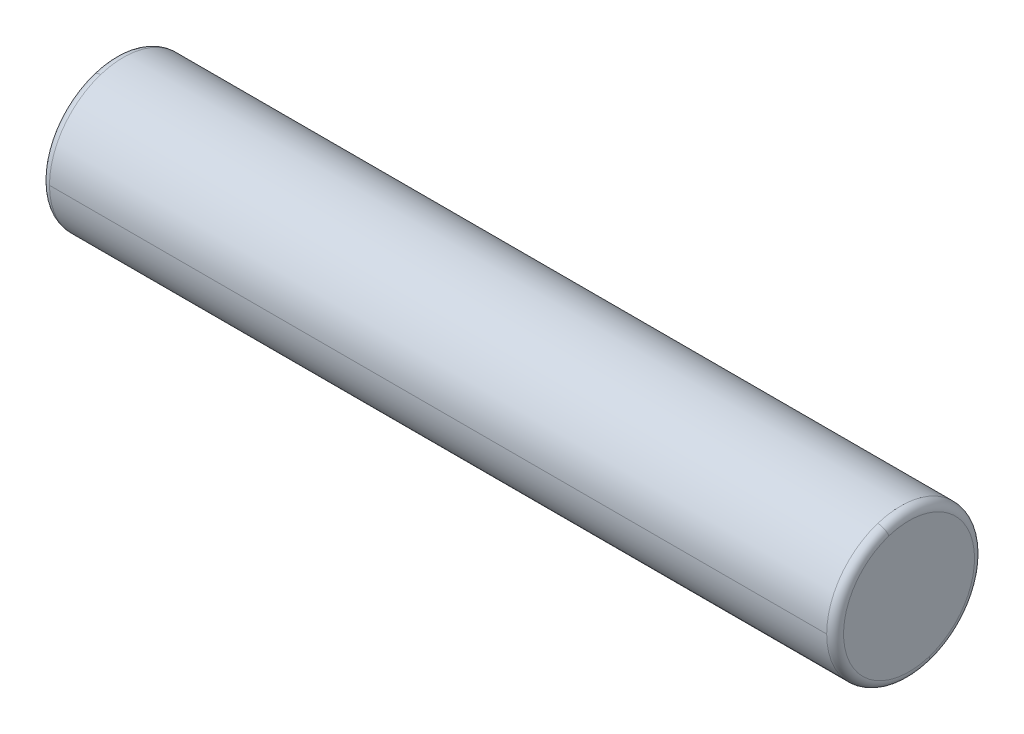
ISO-10303-21;
HEADER;
FILE_DESCRIPTION(('STEP AP214'),'2;1');
FILE_NAME('part.step','',(''),(''),'','','');
FILE_SCHEMA(('AUTOMOTIVE_DESIGN { 1 0 10303 214 1 1 1 1 }'));
ENDSEC;
DATA;
#1=APPLICATION_CONTEXT('core data for automotive mechanical design processes');
#2=APPLICATION_PROTOCOL_DEFINITION('international standard','automotive_design',2000,#1);
#3=PRODUCT_CONTEXT('',#1,'mechanical');
#4=PRODUCT('Part','Part','',(#3));
#5=PRODUCT_RELATED_PRODUCT_CATEGORY('part','',(#4));
#6=PRODUCT_DEFINITION_FORMATION('','',#4);
#7=PRODUCT_DEFINITION_CONTEXT('part definition',#1,'design');
#8=PRODUCT_DEFINITION('design','',#6,#7);
#9=PRODUCT_DEFINITION_SHAPE('','',#8);
#10=(LENGTH_UNIT() NAMED_UNIT(*) SI_UNIT(.MILLI.,.METRE.));
#11=(NAMED_UNIT(*) PLANE_ANGLE_UNIT() SI_UNIT($,.RADIAN.));
#12=(NAMED_UNIT(*) SI_UNIT($,.STERADIAN.) SOLID_ANGLE_UNIT());
#13=UNCERTAINTY_MEASURE_WITH_UNIT(LENGTH_MEASURE(1.E-05),#10,'distance_accuracy_value','');
#14=(GEOMETRIC_REPRESENTATION_CONTEXT(3) GLOBAL_UNCERTAINTY_ASSIGNED_CONTEXT((#13)) GLOBAL_UNIT_ASSIGNED_CONTEXT((#10,
#11,#12)) REPRESENTATION_CONTEXT('',''));
#15=CARTESIAN_POINT('',(0.,0.,0.));
#16=DIRECTION('',(0.,0.,1.));
#17=DIRECTION('',(1.,0.,0.));
#18=AXIS2_PLACEMENT_3D('',#15,#16,#17);
#19=CARTESIAN_POINT('',(3.1,29.25,0.));
#20=DIRECTION('',(1.,0.,0.));
#21=DIRECTION('',(0.,0.,-1.));
#22=AXIS2_PLACEMENT_3D('',#19,#20,#21);
#23=PLANE('',#22);
#24=CARTESIAN_POINT('',(3.1,30.724137600257,0.478976341281001));
#25=CARTESIAN_POINT('',(3.1,30.7163008719419,0.503097051966079));
#26=CARTESIAN_POINT('',(3.1,30.7078711460442,0.527025037923453));
#27=CARTESIAN_POINT('',(3.1,30.6898482176225,0.574438756045452));
#28=CARTESIAN_POINT('',(3.1,30.6802550150986,0.597924488210076));
#29=CARTESIAN_POINT('',(3.1,30.6599276519636,0.644396894409227));
#30=CARTESIAN_POINT('',(3.1,30.6491934913525,0.667383568443754));
#31=CARTESIAN_POINT('',(3.1,30.6266102302895,0.712802541800716));
#32=CARTESIAN_POINT('',(3.1,30.6147611298377,0.735234841123151));
#33=CARTESIAN_POINT('',(3.1,30.589976492087,0.779491007516879));
#34=CARTESIAN_POINT('',(3.1,30.5770409547882,0.801314874588172));
#35=CARTESIAN_POINT('',(3.1,30.550114617581,0.844301605203733));
#36=CARTESIAN_POINT('',(3.1,30.5361238176727,0.865464468748));
#37=CARTESIAN_POINT('',(3.1,30.5071206572556,0.907078207956979));
#38=CARTESIAN_POINT('',(3.1,30.4921082967468,0.92752908362169));
#39=CARTESIAN_POINT('',(3.1,30.4610981820384,0.967669579431778));
#40=CARTESIAN_POINT('',(3.1,30.4451004278388,0.987359199577156));
#41=CARTESIAN_POINT('',(3.1,30.4121580655205,1.02592975024571));
#42=CARTESIAN_POINT('',(3.1,30.3952134574019,1.04481068076889));
#43=CARTESIAN_POINT('',(3.1,30.3604182083495,1.08171836639997));
#44=CARTESIAN_POINT('',(3.1,30.3425675674158,1.09974512150787));
#45=CARTESIAN_POINT('',(3.1,30.306003256475,1.1349010282704));
#46=CARTESIAN_POINT('',(3.1,30.2872895864679,1.15203017992503));
#47=CARTESIAN_POINT('',(3.1,30.2490443002548,1.18534961415595));
#48=CARTESIAN_POINT('',(3.1,30.2295126840488,1.20153989673224));
#49=CARTESIAN_POINT('',(3.1,30.189678558811,1.23294258899722));
#50=CARTESIAN_POINT('',(3.1,30.1693760497791,1.24815499868591));
#51=CARTESIAN_POINT('',(3.1,30.1280490494124,1.27756529714842));
#52=CARTESIAN_POINT('',(3.1,30.1070245580776,1.29176318592224));
#53=CARTESIAN_POINT('',(3.1,30.0643042429459,1.31911023859733));
#54=CARTESIAN_POINT('',(3.1,30.0426084191492,1.33225940249861));
#55=CARTESIAN_POINT('',(3.1,29.9985977062335,1.35747732794104));
#56=CARTESIAN_POINT('',(3.1,29.9762828171147,1.36954608948221));
#57=CARTESIAN_POINT('',(3.1,29.9310877320774,1.39257413550077));
#58=CARTESIAN_POINT('',(3.1,29.908207536159,1.40353341997817));
#59=CARTESIAN_POINT('',(3.1,29.8619369579185,1.42431610999299));
#60=CARTESIAN_POINT('',(3.1,29.8385465755964,1.4341395155304));
#61=CARTESIAN_POINT('',(3.1,29.7913119740285,1.45262678222088));
#62=CARTESIAN_POINT('',(3.1,29.7674677547827,1.46129064337394));
#63=CARTESIAN_POINT('',(3.1,29.7193829221799,1.47743794929532));
#64=CARTESIAN_POINT('',(3.1,29.6951423088229,1.48492139406364));
#65=CARTESIAN_POINT('',(3.1,29.6463230857586,1.49868983894163));
#66=CARTESIAN_POINT('',(3.1,29.6217444760512,1.50497483905129));
#67=CARTESIAN_POINT('',(3.1,29.5723084723099,1.5163312534962));
#68=CARTESIAN_POINT('',(3.1,29.5474510782758,1.52140266783144));
#69=CARTESIAN_POINT('',(3.1,29.4975173895205,1.53031969324616));
#70=CARTESIAN_POINT('',(3.1,29.4724410947992,1.53416530432564));
#71=CARTESIAN_POINT('',(3.1,29.4221300156598,1.54062145881492));
#72=CARTESIAN_POINT('',(3.1,29.3968952312417,1.54323200222472));
#73=CARTESIAN_POINT('',(3.1,29.3463279655146,1.5472117323469));
#74=CARTESIAN_POINT('',(3.1,29.3209954842056,1.54858091905928));
#75=CARTESIAN_POINT('',(3.1,29.2702938528631,1.55007463729591));
#76=CARTESIAN_POINT('',(3.1,29.2449247028296,1.55019916882015));
#77=CARTESIAN_POINT('',(3.1,29.1942108505425,1.54920327667317));
#78=CARTESIAN_POINT('',(3.1,29.168866148289,1.54808285300193));
#79=CARTESIAN_POINT('',(3.1,29.1182622491695,1.54459974966274));
#80=CARTESIAN_POINT('',(3.1,29.0930030523037,1.54223706999478));
#81=CARTESIAN_POINT('',(3.1,29.0426310155772,1.53627514656442));
#82=CARTESIAN_POINT('',(3.1,29.0175181757166,1.532675902802));
#83=CARTESIAN_POINT('',(3.1,28.9674993520317,1.52424952207621));
#84=CARTESIAN_POINT('',(3.1,28.9425933682073,1.51942238511282));
#85=CARTESIAN_POINT('',(3.1,28.8930482572913,1.50855184698083));
#86=CARTESIAN_POINT('',(3.1,28.8684091301996,1.50250844581222));
#87=CARTESIAN_POINT('',(3.1,28.8194570905643,1.48921993835254));
#88=CARTESIAN_POINT('',(3.1,28.7951441780207,1.48197483206146));
#89=CARTESIAN_POINT('',(3.1,28.7469031394173,1.46630036845249));
#90=CARTESIAN_POINT('',(3.1,28.7229750133576,1.4578710111346));
#91=CARTESIAN_POINT('',(3.1,28.6755611926735,1.4398483525321));
#92=CARTESIAN_POINT('',(3.1,28.6520754980492,1.43025505124749));
#93=CARTESIAN_POINT('',(3.1,28.6056031193315,1.40992761581464));
#94=CARTESIAN_POINT('',(3.1,28.5826164352381,1.39919348166639));
#95=CARTESIAN_POINT('',(3.1,28.5371974545175,1.37661023997561));
#96=CARTESIAN_POINT('',(3.1,28.5147651578903,1.36476113243307));
#97=CARTESIAN_POINT('',(3.1,28.4705089934697,1.33997648949166));
#98=CARTESIAN_POINT('',(3.1,28.4486851256762,1.32704095409277));
#99=CARTESIAN_POINT('',(3.1,28.4056983945319,1.30011461827644));
#100=CARTESIAN_POINT('',(3.1,28.3845355311812,1.286123817859));
#101=CARTESIAN_POINT('',(3.1,28.3429217921139,1.25712065706921));
#102=CARTESIAN_POINT('',(3.1,28.3224709163973,1.24210829669686));
#103=CARTESIAN_POINT('',(3.1,28.2823304205492,1.21109818208833));
#104=CARTESIAN_POINT('',(3.1,28.2626408004178,1.19510042785215));
#105=CARTESIAN_POINT('',(3.1,28.2240702497594,1.16215806550713));
#106=CARTESIAN_POINT('',(3.1,28.2051893192325,1.1452134573983));
#107=CARTESIAN_POINT('',(3.1,28.1682816335987,1.1104182083531));
#108=CARTESIAN_POINT('',(3.1,28.1502548784918,1.09256756741673));
#109=CARTESIAN_POINT('',(3.1,28.11509897173,1.056003256474));
#110=CARTESIAN_POINT('',(3.1,28.0979698200751,1.03728958646764));
#111=CARTESIAN_POINT('',(3.1,28.064650385844,0.999044300255088));
#112=CARTESIAN_POINT('',(3.1,28.0484601032677,0.979512684048904));
#113=CARTESIAN_POINT('',(3.1,28.0170574110028,0.939678558810919));
#114=CARTESIAN_POINT('',(3.1,28.0018450013141,0.919376049779119));
#115=CARTESIAN_POINT('',(3.1,27.9724347028516,0.878049049412452));
#116=CARTESIAN_POINT('',(3.1,27.9582368140778,0.857024558077586));
#117=CARTESIAN_POINT('',(3.1,27.9308897614027,0.814304242945939));
#118=CARTESIAN_POINT('',(3.1,27.9177405975014,0.792608419149159));
#119=CARTESIAN_POINT('',(3.1,27.892522672059,0.748597706233541));
#120=CARTESIAN_POINT('',(3.1,27.8804539105178,0.726282817114703));
#121=CARTESIAN_POINT('',(3.1,27.8574258644992,0.68108773207741));
#122=CARTESIAN_POINT('',(3.1,27.8464665800218,0.658207536158955));
#123=CARTESIAN_POINT('',(3.1,27.825683890007,0.611936957918464));
#124=CARTESIAN_POINT('',(3.1,27.8158604844696,0.588546575596428));
#125=CARTESIAN_POINT('',(3.1,27.7973732177791,0.541311974028549));
#126=CARTESIAN_POINT('',(3.1,27.7887093566261,0.517467754782707));
#127=CARTESIAN_POINT('',(3.1,27.7725620507047,0.469382922179862));
#128=CARTESIAN_POINT('',(3.1,27.7650786059363,0.44514230882286));
#129=CARTESIAN_POINT('',(3.1,27.7513101610584,0.396323085758586));
#130=CARTESIAN_POINT('',(3.1,27.745025160949,0.371744476051314));
#131=CARTESIAN_POINT('',(3.1,27.7336687465035,0.322308472309799));
#132=CARTESIAN_POINT('',(3.1,27.7285973321676,0.297451078275557));
#133=CARTESIAN_POINT('',(3.1,27.7196803067548,0.247517389520762));
#134=CARTESIAN_POINT('',(3.1,27.7158346956781,0.222441094800211));
#135=CARTESIAN_POINT('',(3.1,27.7093785411814,0.172130015658794));
#136=CARTESIAN_POINT('',(3.1,27.7067679977615,0.146895231237927));
#137=CARTESIAN_POINT('',(3.1,27.7027882676669,0.0963279655183182));
#138=CARTESIAN_POINT('',(3.1,27.7014190809923,0.0709954842195761));
#139=CARTESIAN_POINT('',(3.1,27.6999253626525,0.0202938528490886));
#140=CARTESIAN_POINT('',(3.1,27.6998008309875,-0.00507529722265686));
#141=CARTESIAN_POINT('',(3.1,27.7007967235192,-0.0557891494052583));
#142=CARTESIAN_POINT('',(3.1,27.7019171477161,-0.0811338515161143));
#143=CARTESIAN_POINT('',(3.1,27.7054002496193,-0.131737751025358));
#144=CARTESIAN_POINT('',(3.1,27.7077629273256,-0.156996948423746));
#145=CARTESIAN_POINT('',(3.1,27.7137248561152,-0.207368983695411));
#146=CARTESIAN_POINT('',(3.1,27.7173241071983,-0.232481821568688));
#147=CARTESIAN_POINT('',(3.1,27.7257504679235,-0.282500650682992));
#148=CARTESIAN_POINT('',(3.1,27.7305775775655,-0.30740664192402));
#149=CARTESIAN_POINT('',(3.1,27.7414481903408,-0.356951732577393));
#150=CARTESIAN_POINT('',(3.1,27.7474916934742,-0.381590831989738));
#151=CARTESIAN_POINT('',(3.1,27.7607799223611,-0.430542947246312));
#152=CARTESIAN_POINT('',(3.1,27.7680246481147,-0.454855963090541));
#153=CARTESIAN_POINT('',(3.1,27.775862399743,-0.478976341280996));
#154=B_SPLINE_CURVE_WITH_KNOTS('',3,(#24,#25,#26,#27,#28,#29,#30,#31,#32,#33,#34,#35,#36,#37,
#38,#39,#40,#41,#42,#43,#44,#45,#46,#47,#48,#49,#50,#51,#52,#53,#54,#55,#56,#57,#58,#59,#60,#61,
#62,#63,#64,#65,#66,#67,#68,#69,#70,#71,#72,#73,#74,#75,#76,#77,#78,#79,#80,#81,#82,#83,#84,#85,
#86,#87,#88,#89,#90,#91,#92,#93,#94,#95,#96,#97,#98,#99,#100,#101,#102,#103,#104,#105,#106,#107,
#108,#109,#110,#111,#112,#113,#114,#115,#116,#117,#118,#119,#120,#121,#122,#123,#124,#125,#126,
#127,#128,#129,#130,#131,#132,#133,#134,#135,#136,#137,#138,#139,#140,#141,#142,#143,#144,#145,
#146,#147,#148,#149,#150,#151,#152,#153),.UNSPECIFIED.,.F.,.F.,(4,2,2,2,2,2,2,2,2,2,2,2,2,2,2,2,
2,2,2,2,2,2,2,2,2,2,2,2,2,2,2,2,2,2,2,2,2,2,2,2,2,2,2,2,2,2,2,2,2,2,2,2,2,2,2,2,2,2,2,2,2,2,2,2,
4),(0.,0.0760778084210016,0.152155616842003,0.228233425263003,0.304311233684006,
0.380389042105006,0.456466850526008,0.53254465894701,0.608622467368011,0.684700275789012,
0.760778084210015,0.836855892631017,0.912933701052018,0.989011509473018,1.06508931789402,
1.14116712631502,1.21724493473602,1.29332274315702,1.36940055157803,1.44547835999903,
1.52155616842003,1.59763397684103,1.67371178526203,1.74978959368303,1.82586740210404,
1.90194521052504,1.97802301894604,2.05410082736704,2.13017863578804,2.20625644420904,
2.28233425263004,2.35841206105104,2.43448986947205,2.51056767789305,2.58664548631405,
2.66272329473505,2.73880110315605,2.81487891157705,2.89095671999805,2.96703452841906,
3.04311233684006,3.11919014526106,3.19526795368206,3.27134576210306,3.34742357052406,
3.42350137894507,3.49957918736607,3.57565699578707,3.65173480420807,3.72781261262907,
3.80389042105007,3.87996822947107,3.95604603789208,4.03212384631308,4.10820165473408,
4.18427946315508,4.26035727157608,4.33643507999708,4.41251288841808,4.48859069683909,
4.56466850526009,4.64074631368109,4.71682412210209,4.79290193052309,4.86897973894409),.UNSPECIFIED.);
#155=CARTESIAN_POINT('',(3.1,30.724137600257,0.478976341281001));
#156=VERTEX_POINT('',#155);
#157=CARTESIAN_POINT('',(3.1,27.775862399743,-0.478976341281001));
#158=VERTEX_POINT('',#157);
#159=EDGE_CURVE('E11',#156,#158,#154,.T.);
#160=ORIENTED_EDGE('',*,*,#159,.F.);
#161=CARTESIAN_POINT('',(3.1,27.775862399743,-0.478976341281001));
#162=CARTESIAN_POINT('',(3.1,27.7836991280581,-0.503097051966078));
#163=CARTESIAN_POINT('',(3.1,27.7921288539558,-0.527025037923453));
#164=CARTESIAN_POINT('',(3.1,27.8101517823775,-0.574438756045452));
#165=CARTESIAN_POINT('',(3.1,27.8197449849014,-0.597924488210076));
#166=CARTESIAN_POINT('',(3.1,27.8400723480365,-0.644396894409227));
#167=CARTESIAN_POINT('',(3.1,27.8508065086475,-0.667383568443754));
#168=CARTESIAN_POINT('',(3.1,27.8733897697105,-0.712802541800716));
#169=CARTESIAN_POINT('',(3.1,27.8852388701623,-0.735234841123151));
#170=CARTESIAN_POINT('',(3.1,27.910023507913,-0.779491007516879));
#171=CARTESIAN_POINT('',(3.1,27.9229590452118,-0.801314874588172));
#172=CARTESIAN_POINT('',(3.1,27.949885382419,-0.844301605203732));
#173=CARTESIAN_POINT('',(3.1,27.9638761823273,-0.865464468748));
#174=CARTESIAN_POINT('',(3.1,27.9928793427445,-0.907078207956979));
#175=CARTESIAN_POINT('',(3.1,28.0078917032532,-0.92752908362169));
#176=CARTESIAN_POINT('',(3.1,28.0389018179616,-0.967669579431778));
#177=CARTESIAN_POINT('',(3.1,28.0548995721612,-0.987359199577155));
#178=CARTESIAN_POINT('',(3.1,28.0878419344795,-1.02592975024571));
#179=CARTESIAN_POINT('',(3.1,28.1047865425981,-1.04481068076889));
#180=CARTESIAN_POINT('',(3.1,28.1395817916505,-1.08171836639997));
#181=CARTESIAN_POINT('',(3.1,28.1574324325842,-1.09974512150787));
#182=CARTESIAN_POINT('',(3.1,28.193996743525,-1.1349010282704));
#183=CARTESIAN_POINT('',(3.1,28.2127104135321,-1.15203017992503));
#184=CARTESIAN_POINT('',(3.1,28.2509556997452,-1.18534961415595));
#185=CARTESIAN_POINT('',(3.1,28.2704873159512,-1.20153989673224));
#186=CARTESIAN_POINT('',(3.1,28.310321441189,-1.23294258899722));
#187=CARTESIAN_POINT('',(3.1,28.3306239502209,-1.24815499868591));
#188=CARTESIAN_POINT('',(3.1,28.3719509505876,-1.27756529714842));
#189=CARTESIAN_POINT('',(3.1,28.3929754419224,-1.29176318592224));
#190=CARTESIAN_POINT('',(3.1,28.4356957570541,-1.31911023859733));
#191=CARTESIAN_POINT('',(3.1,28.4573915808508,-1.33225940249861));
#192=CARTESIAN_POINT('',(3.1,28.5014022937665,-1.35747732794104));
#193=CARTESIAN_POINT('',(3.1,28.5237171828853,-1.3695460894822));
#194=CARTESIAN_POINT('',(3.1,28.5689122679226,-1.39257413550077));
#195=CARTESIAN_POINT('',(3.1,28.591792463841,-1.40353341997817));
#196=CARTESIAN_POINT('',(3.1,28.6380630420815,-1.42431610999299));
#197=CARTESIAN_POINT('',(3.1,28.6614534244036,-1.4341395155304));
#198=CARTESIAN_POINT('',(3.1,28.7086880259715,-1.45262678222088));
#199=CARTESIAN_POINT('',(3.1,28.7325322452173,-1.46129064337394));
#200=CARTESIAN_POINT('',(3.1,28.7806170778201,-1.47743794929532));
#201=CARTESIAN_POINT('',(3.1,28.8048576911771,-1.48492139406364));
#202=CARTESIAN_POINT('',(3.1,28.8536769142414,-1.49868983894162));
#203=CARTESIAN_POINT('',(3.1,28.8782555239488,-1.50497483905129));
#204=CARTESIAN_POINT('',(3.1,28.9276915276901,-1.5163312534962));
#205=CARTESIAN_POINT('',(3.1,28.9525489217242,-1.52140266783144));
#206=CARTESIAN_POINT('',(3.1,29.0024826104795,-1.53031969324616));
#207=CARTESIAN_POINT('',(3.1,29.0275589052008,-1.53416530432564));
#208=CARTESIAN_POINT('',(3.1,29.0778699843402,-1.54062145881492));
#209=CARTESIAN_POINT('',(3.1,29.1031047687583,-1.54323200222472));
#210=CARTESIAN_POINT('',(3.1,29.1536720344854,-1.5472117323469));
#211=CARTESIAN_POINT('',(3.1,29.1790045157944,-1.54858091905928));
#212=CARTESIAN_POINT('',(3.1,29.2297061471369,-1.55007463729591));
#213=CARTESIAN_POINT('',(3.1,29.2550752971704,-1.55019916882015));
#214=CARTESIAN_POINT('',(3.1,29.3057891494575,-1.54920327667317));
#215=CARTESIAN_POINT('',(3.1,29.331133851711,-1.54808285300193));
#216=CARTESIAN_POINT('',(3.1,29.3817377508305,-1.54459974966274));
#217=CARTESIAN_POINT('',(3.1,29.4069969476964,-1.54223706999478));
#218=CARTESIAN_POINT('',(3.1,29.4573689844228,-1.53627514656442));
#219=CARTESIAN_POINT('',(3.1,29.4824818242834,-1.532675902802));
#220=CARTESIAN_POINT('',(3.1,29.5325006479683,-1.52424952207621));
#221=CARTESIAN_POINT('',(3.1,29.5574066317927,-1.51942238511282));
#222=CARTESIAN_POINT('',(3.1,29.6069517427087,-1.50855184698083));
#223=CARTESIAN_POINT('',(3.1,29.6315908698004,-1.50250844581222));
#224=CARTESIAN_POINT('',(3.1,29.6805429094357,-1.48921993835254));
#225=CARTESIAN_POINT('',(3.1,29.7048558219793,-1.48197483206146));
#226=CARTESIAN_POINT('',(3.1,29.7530968605827,-1.46630036845249));
#227=CARTESIAN_POINT('',(3.1,29.7770249866424,-1.4578710111346));
#228=CARTESIAN_POINT('',(3.1,29.8244388073265,-1.4398483525321));
#229=CARTESIAN_POINT('',(3.1,29.8479245019508,-1.43025505124749));
#230=CARTESIAN_POINT('',(3.1,29.8943968806685,-1.40992761581464));
#231=CARTESIAN_POINT('',(3.1,29.9173835647619,-1.39919348166639));
#232=CARTESIAN_POINT('',(3.1,29.9628025454825,-1.37661023997561));
#233=CARTESIAN_POINT('',(3.1,29.9852348421097,-1.36476113243307));
#234=CARTESIAN_POINT('',(3.1,30.0294910065303,-1.33997648949166));
#235=CARTESIAN_POINT('',(3.1,30.0513148743238,-1.32704095409277));
#236=CARTESIAN_POINT('',(3.1,30.0943016054681,-1.30011461827644));
#237=CARTESIAN_POINT('',(3.1,30.1154644688188,-1.286123817859));
#238=CARTESIAN_POINT('',(3.1,30.1570782078861,-1.25712065706921));
#239=CARTESIAN_POINT('',(3.1,30.1775290836027,-1.24210829669686));
#240=CARTESIAN_POINT('',(3.1,30.2176695794508,-1.21109818208833));
#241=CARTESIAN_POINT('',(3.1,30.2373591995822,-1.19510042785215));
#242=CARTESIAN_POINT('',(3.1,30.2759297502406,-1.16215806550713));
#243=CARTESIAN_POINT('',(3.1,30.2948106807675,-1.1452134573983));
#244=CARTESIAN_POINT('',(3.1,30.3317183664013,-1.1104182083531));
#245=CARTESIAN_POINT('',(3.1,30.3497451215082,-1.09256756741673));
#246=CARTESIAN_POINT('',(3.1,30.38490102827,-1.056003256474));
#247=CARTESIAN_POINT('',(3.1,30.4020301799249,-1.03728958646764));
#248=CARTESIAN_POINT('',(3.1,30.435349614156,-0.99904430025509));
#249=CARTESIAN_POINT('',(3.1,30.4515398967323,-0.979512684048905));
#250=CARTESIAN_POINT('',(3.1,30.4829425889972,-0.93967855881092));
#251=CARTESIAN_POINT('',(3.1,30.4981549986859,-0.919376049779121));
#252=CARTESIAN_POINT('',(3.1,30.5275652971484,-0.878049049412455));
#253=CARTESIAN_POINT('',(3.1,30.5417631859222,-0.857024558077588));
#254=CARTESIAN_POINT('',(3.1,30.5691102385973,-0.814304242945941));
#255=CARTESIAN_POINT('',(3.1,30.5822594024986,-0.792608419149161));
#256=CARTESIAN_POINT('',(3.1,30.607477327941,-0.748597706233543));
#257=CARTESIAN_POINT('',(3.1,30.6195460894822,-0.726282817114704));
#258=CARTESIAN_POINT('',(3.1,30.6425741355008,-0.681087732077411));
#259=CARTESIAN_POINT('',(3.1,30.6535334199782,-0.658207536158957));
#260=CARTESIAN_POINT('',(3.1,30.674316109993,-0.611936957918467));
#261=CARTESIAN_POINT('',(3.1,30.6841395155304,-0.58854657559643));
#262=CARTESIAN_POINT('',(3.1,30.7026267822209,-0.541311974028552));
#263=CARTESIAN_POINT('',(3.1,30.7112906433739,-0.517467754782709));
#264=CARTESIAN_POINT('',(3.1,30.7274379492953,-0.469382922179864));
#265=CARTESIAN_POINT('',(3.1,30.7349213940637,-0.445142308822862));
#266=CARTESIAN_POINT('',(3.1,30.7486898389416,-0.396323085758588));
#267=CARTESIAN_POINT('',(3.1,30.754974839051,-0.371744476051316));
#268=CARTESIAN_POINT('',(3.1,30.7663312534965,-0.322308472309802));
#269=CARTESIAN_POINT('',(3.1,30.7714026678324,-0.297451078275559));
#270=CARTESIAN_POINT('',(3.1,30.7803196932452,-0.247517389520765));
#271=CARTESIAN_POINT('',(3.1,30.7841653043219,-0.222441094800213));
#272=CARTESIAN_POINT('',(3.1,30.7906214588186,-0.172130015658796));
#273=CARTESIAN_POINT('',(3.1,30.7932320022385,-0.146895231237929));
#274=CARTESIAN_POINT('',(3.1,30.7972117323331,-0.0963279655183212));
#275=CARTESIAN_POINT('',(3.1,30.7985809190077,-0.0709954842195791));
#276=CARTESIAN_POINT('',(3.1,30.8000746373475,-0.0202938528490916));
#277=CARTESIAN_POINT('',(3.1,30.8001991690125,0.00507529722265386));
#278=CARTESIAN_POINT('',(3.1,30.7992032764808,0.0557891494052553));
#279=CARTESIAN_POINT('',(3.1,30.7980828522839,0.0811338515161114));
#280=CARTESIAN_POINT('',(3.1,30.7945997503807,0.131737751025355));
#281=CARTESIAN_POINT('',(3.1,30.7922370726744,0.156996948423743));
#282=CARTESIAN_POINT('',(3.1,30.7862751438848,0.207368983695409));
#283=CARTESIAN_POINT('',(3.1,30.7826758928017,0.232481821568686));
#284=CARTESIAN_POINT('',(3.1,30.7742495320765,0.282500650682991));
#285=CARTESIAN_POINT('',(3.1,30.7694224224345,0.307406641924018));
#286=CARTESIAN_POINT('',(3.1,30.7585518096592,0.356951732577391));
#287=CARTESIAN_POINT('',(3.1,30.7525083065258,0.381590831989736));
#288=CARTESIAN_POINT('',(3.1,30.7392200776389,0.43054294724631));
#289=CARTESIAN_POINT('',(3.1,30.7319753518853,0.454855963090539));
#290=CARTESIAN_POINT('',(3.1,30.724137600257,0.478976341280993));
#291=B_SPLINE_CURVE_WITH_KNOTS('',3,(#161,#162,#163,#164,#165,#166,#167,#168,#169,#170,#171,
#172,#173,#174,#175,#176,#177,#178,#179,#180,#181,#182,#183,#184,#185,#186,#187,#188,#189,#190,
#191,#192,#193,#194,#195,#196,#197,#198,#199,#200,#201,#202,#203,#204,#205,#206,#207,#208,#209,
#210,#211,#212,#213,#214,#215,#216,#217,#218,#219,#220,#221,#222,#223,#224,#225,#226,#227,#228,
#229,#230,#231,#232,#233,#234,#235,#236,#237,#238,#239,#240,#241,#242,#243,#244,#245,#246,#247,
#248,#249,#250,#251,#252,#253,#254,#255,#256,#257,#258,#259,#260,#261,#262,#263,#264,#265,#266,
#267,#268,#269,#270,#271,#272,#273,#274,#275,#276,#277,#278,#279,#280,#281,#282,#283,#284,#285,
#286,#287,#288,#289,#290),.UNSPECIFIED.,.F.,.F.,(4,2,2,2,2,2,2,2,2,2,2,2,2,2,2,2,2,2,2,2,2,2,2,
2,2,2,2,2,2,2,2,2,2,2,2,2,2,2,2,2,2,2,2,2,2,2,2,2,2,2,2,2,2,2,2,2,2,2,2,2,2,2,2,2,4),(0.,
0.0760778084210017,0.152155616842002,0.228233425263003,0.304311233684006,0.380389042105006,
0.456466850526008,0.53254465894701,0.60862246736801,0.684700275789012,0.760778084210015,
0.836855892631014,0.912933701052015,0.989011509473018,1.06508931789402,1.14116712631502,
1.21724493473602,1.29332274315702,1.36940055157803,1.44547835999903,1.52155616842003,
1.59763397684103,1.67371178526203,1.74978959368303,1.82586740210403,1.90194521052504,
1.97802301894604,2.05410082736704,2.13017863578804,2.20625644420904,2.28233425263004,
2.35841206105105,2.43448986947204,2.51056767789305,2.58664548631405,2.66272329473505,
2.73880110315605,2.81487891157705,2.89095671999806,2.96703452841906,3.04311233684006,
3.11919014526106,3.19526795368206,3.27134576210306,3.34742357052406,3.42350137894507,
3.49957918736607,3.57565699578707,3.65173480420807,3.72781261262907,3.80389042105007,
3.87996822947107,3.95604603789207,4.03212384631308,4.10820165473408,4.18427946315508,
4.26035727157608,4.33643507999708,4.41251288841808,4.48859069683908,4.56466850526008,
4.64074631368109,4.71682412210209,4.79290193052309,4.86897973894409),.UNSPECIFIED.);
#292=EDGE_CURVE('E25',#158,#156,#291,.T.);
#293=ORIENTED_EDGE('',*,*,#292,.F.);
#294=EDGE_LOOP('',(#160,#293));
#295=FACE_BOUND('',#294,.T.);
#296=ADVANCED_FACE('F16',(#295),#23,.F.);
#297=CARTESIAN_POINT('',(3.30000000000054,29.25,0.));
#298=DIRECTION('',(1.,0.,0.));
#299=DIRECTION('',(0.,-0.309016994374947,0.951056516295154));
#300=AXIS2_PLACEMENT_3D('',#297,#298,#299);
#301=TOROIDAL_SURFACE('',#300,1.54999999999946,0.200000000000541);
#302=CARTESIAN_POINT('',(3.30000000000054,27.775862399743,-0.478976341281001));
#303=DIRECTION('',(0.,0.309016994374946,-0.951056516295154));
#304=DIRECTION('',(-2.70228284193032E-12,-0.951056516295154,-0.309016994374946));
#305=AXIS2_PLACEMENT_3D('',#302,#303,#304);
#306=CIRCLE('',#305,0.200000000000541);
#307=CARTESIAN_POINT('',(3.3,27.5856510964835,-0.540779740156158));
#308=VERTEX_POINT('',#307);
#309=EDGE_CURVE('E138',#308,#158,#306,.T.);
#310=ORIENTED_EDGE('',*,*,#309,.T.);
#311=ORIENTED_EDGE('',*,*,#292,.T.);
#312=CARTESIAN_POINT('',(3.30000000000054,30.724137600257,0.478976341281002));
#313=DIRECTION('',(0.,-0.309016994374946,0.951056516295154));
#314=DIRECTION('',(-2.70228284193032E-12,0.951056516295154,0.309016994374946));
#315=AXIS2_PLACEMENT_3D('',#312,#313,#314);
#316=CIRCLE('',#315,0.200000000000541);
#317=CARTESIAN_POINT('',(3.3,30.9143489035165,0.540779740156158));
#318=VERTEX_POINT('',#317);
#319=EDGE_CURVE('E134',#318,#156,#316,.T.);
#320=ORIENTED_EDGE('',*,*,#319,.F.);
#321=CARTESIAN_POINT('',(3.3,29.25,0.));
#322=DIRECTION('',(1.,0.,0.));
#323=DIRECTION('',(0.,0.,-1.));
#324=AXIS2_PLACEMENT_3D('',#321,#322,#323);
#325=CIRCLE('',#324,1.75);
#326=CARTESIAN_POINT('',(3.3,29.25,-1.75));
#327=VERTEX_POINT('',#326);
#328=EDGE_CURVE('E129',#327,#318,#325,.T.);
#329=ORIENTED_EDGE('',*,*,#328,.F.);
#330=CARTESIAN_POINT('',(3.3,29.25,0.));
#331=DIRECTION('',(1.,0.,0.));
#332=DIRECTION('',(0.,0.,-1.));
#333=AXIS2_PLACEMENT_3D('',#330,#331,#332);
#334=CIRCLE('',#333,1.75);
#335=EDGE_CURVE('E124',#308,#327,#334,.T.);
#336=ORIENTED_EDGE('',*,*,#335,.F.);
#337=EDGE_LOOP('',(#310,#311,#320,#329,#336));
#338=FACE_BOUND('',#337,.T.);
#339=ADVANCED_FACE('F145',(#338),#301,.T.);
#340=CARTESIAN_POINT('',(21.9,29.25,0.));
#341=DIRECTION('',(1.,0.,0.));
#342=DIRECTION('',(0.,1.,0.));
#343=AXIS2_PLACEMENT_3D('',#340,#341,#342);
#344=CYLINDRICAL_SURFACE('',#343,1.75);
#345=DIRECTION('',(1.,0.,0.));
#346=VECTOR('',#345,1.);
#347=CARTESIAN_POINT('',(3.3,29.25,1.75));
#348=LINE('',#347,#346);
#349=CARTESIAN_POINT('',(3.3,29.25,1.75));
#350=VERTEX_POINT('',#349);
#351=CARTESIAN_POINT('',(21.7,29.25,1.75));
#352=VERTEX_POINT('',#351);
#353=EDGE_CURVE('E91',#350,#352,#348,.T.);
#354=ORIENTED_EDGE('',*,*,#353,.F.);
#355=CARTESIAN_POINT('',(3.3,29.25,0.));
#356=DIRECTION('',(1.,0.,0.));
#357=DIRECTION('',(0.,0.,-1.));
#358=AXIS2_PLACEMENT_3D('',#355,#356,#357);
#359=CIRCLE('',#358,1.75);
#360=EDGE_CURVE('E116',#350,#308,#359,.T.);
#361=ORIENTED_EDGE('',*,*,#360,.T.);
#362=ORIENTED_EDGE('',*,*,#335,.T.);
#363=DIRECTION('',(1.,0.,0.));
#364=VECTOR('',#363,1.);
#365=CARTESIAN_POINT('',(3.3,29.25,-1.75));
#366=LINE('',#365,#364);
#367=CARTESIAN_POINT('',(21.7,29.25,-1.75));
#368=VERTEX_POINT('',#367);
#369=EDGE_CURVE('E112',#327,#368,#366,.T.);
#370=ORIENTED_EDGE('',*,*,#369,.T.);
#371=CARTESIAN_POINT('',(21.7,29.25,0.));
#372=DIRECTION('',(1.,0.,0.));
#373=DIRECTION('',(0.,0.,-1.));
#374=AXIS2_PLACEMENT_3D('',#371,#372,#373);
#375=CIRCLE('',#374,1.75);
#376=CARTESIAN_POINT('',(21.7,27.5856510964835,-0.540779740156158));
#377=VERTEX_POINT('',#376);
#378=EDGE_CURVE('E83',#377,#368,#375,.T.);
#379=ORIENTED_EDGE('',*,*,#378,.F.);
#380=CARTESIAN_POINT('',(21.7,29.25,0.));
#381=DIRECTION('',(1.,0.,0.));
#382=DIRECTION('',(0.,0.,-1.));
#383=AXIS2_PLACEMENT_3D('',#380,#381,#382);
#384=CIRCLE('',#383,1.75);
#385=EDGE_CURVE('E105',#352,#377,#384,.T.);
#386=ORIENTED_EDGE('',*,*,#385,.F.);
#387=EDGE_LOOP('',(#354,#361,#362,#370,#379,#386));
#388=FACE_BOUND('',#387,.T.);
#389=ADVANCED_FACE('F154',(#388),#344,.T.);
#390=CARTESIAN_POINT('',(21.6999999999989,29.25,0.));
#391=DIRECTION('',(1.,0.,0.));
#392=DIRECTION('',(0.,0.309016994374947,-0.951056516295154));
#393=AXIS2_PLACEMENT_3D('',#390,#391,#392);
#394=TOROIDAL_SURFACE('',#393,1.54999999999895,0.20000000000105);
#395=CARTESIAN_POINT('',(21.6999999999989,27.7758623997435,-0.478976341280844));
#396=DIRECTION('',(0.,0.309016994374947,-0.951056516295154));
#397=DIRECTION('',(1.,0.,0.));
#398=AXIS2_PLACEMENT_3D('',#395,#396,#397);
#399=CIRCLE('',#398,0.200000000001051);
#400=CARTESIAN_POINT('',(21.9,27.7758623997435,-0.478976341280844));
#401=VERTEX_POINT('',#400);
#402=EDGE_CURVE('E101',#401,#377,#399,.T.);
#403=ORIENTED_EDGE('',*,*,#402,.F.);
#404=CARTESIAN_POINT('',(21.9,29.25,0.));
#405=DIRECTION('',(1.,0.,0.));
#406=DIRECTION('',(0.,0.,-1.));
#407=AXIS2_PLACEMENT_3D('',#404,#405,#406);
#408=CIRCLE('',#407,1.55);
#409=CARTESIAN_POINT('',(21.9,30.7241376002565,0.478976341280844));
#410=VERTEX_POINT('',#409);
#411=EDGE_CURVE('E73',#410,#401,#408,.T.);
#412=ORIENTED_EDGE('',*,*,#411,.F.);
#413=CARTESIAN_POINT('',(21.6999999999989,30.7241376002565,0.478976341280844));
#414=DIRECTION('',(0.,-0.309016994374947,0.951056516295154));
#415=DIRECTION('',(1.,0.,0.));
#416=AXIS2_PLACEMENT_3D('',#413,#414,#415);
#417=CIRCLE('',#416,0.200000000001051);
#418=CARTESIAN_POINT('',(21.7,30.9143489035165,0.540779740156158));
#419=VERTEX_POINT('',#418);
#420=EDGE_CURVE('E66',#410,#419,#417,.T.);
#421=ORIENTED_EDGE('',*,*,#420,.T.);
#422=CARTESIAN_POINT('',(21.7,29.25,0.));
#423=DIRECTION('',(1.,0.,0.));
#424=DIRECTION('',(0.,0.,-1.));
#425=AXIS2_PLACEMENT_3D('',#422,#423,#424);
#426=CIRCLE('',#425,1.75);
#427=EDGE_CURVE('E71',#419,#352,#426,.T.);
#428=ORIENTED_EDGE('',*,*,#427,.T.);
#429=ORIENTED_EDGE('',*,*,#385,.T.);
#430=EDGE_LOOP('',(#403,#412,#421,#428,#429));
#431=FACE_BOUND('',#430,.T.);
#432=ADVANCED_FACE('F68',(#431),#394,.T.);
#433=CARTESIAN_POINT('',(21.9,29.25,0.));
#434=DIRECTION('',(1.,0.,0.));
#435=DIRECTION('',(0.,-1.,0.));
#436=AXIS2_PLACEMENT_3D('',#433,#434,#435);
#437=CYLINDRICAL_SURFACE('',#436,1.75);
#438=ORIENTED_EDGE('',*,*,#353,.T.);
#439=ORIENTED_EDGE('',*,*,#427,.F.);
#440=CARTESIAN_POINT('',(21.7,29.25,0.));
#441=DIRECTION('',(1.,0.,0.));
#442=DIRECTION('',(0.,0.,-1.));
#443=AXIS2_PLACEMENT_3D('',#440,#441,#442);
#444=CIRCLE('',#443,1.75);
#445=EDGE_CURVE('E80',#368,#419,#444,.T.);
#446=ORIENTED_EDGE('',*,*,#445,.F.);
#447=ORIENTED_EDGE('',*,*,#369,.F.);
#448=ORIENTED_EDGE('',*,*,#328,.T.);
#449=CARTESIAN_POINT('',(3.3,29.25,0.));
#450=DIRECTION('',(1.,0.,0.));
#451=DIRECTION('',(0.,0.,-1.));
#452=AXIS2_PLACEMENT_3D('',#449,#450,#451);
#453=CIRCLE('',#452,1.75);
#454=EDGE_CURVE('E86',#318,#350,#453,.T.);
#455=ORIENTED_EDGE('',*,*,#454,.T.);
#456=EDGE_LOOP('',(#438,#439,#446,#447,#448,#455));
#457=FACE_BOUND('',#456,.T.);
#458=ADVANCED_FACE('F89',(#457),#437,.T.);
#459=CARTESIAN_POINT('',(3.30000000000054,29.25,0.));
#460=DIRECTION('',(1.,0.,0.));
#461=DIRECTION('',(0.,0.309016994374947,-0.951056516295154));
#462=AXIS2_PLACEMENT_3D('',#459,#460,#461);
#463=TOROIDAL_SURFACE('',#462,1.54999999999946,0.200000000000541);
#464=ORIENTED_EDGE('',*,*,#309,.F.);
#465=ORIENTED_EDGE('',*,*,#360,.F.);
#466=ORIENTED_EDGE('',*,*,#454,.F.);
#467=ORIENTED_EDGE('',*,*,#319,.T.);
#468=ORIENTED_EDGE('',*,*,#159,.T.);
#469=EDGE_LOOP('',(#464,#465,#466,#467,#468));
#470=FACE_BOUND('',#469,.T.);
#471=ADVANCED_FACE('F163',(#470),#463,.T.);
#472=CARTESIAN_POINT('',(21.6999999999989,29.25,0.));
#473=DIRECTION('',(1.,0.,0.));
#474=DIRECTION('',(0.,-0.309016994374947,0.951056516295154));
#475=AXIS2_PLACEMENT_3D('',#472,#473,#474);
#476=TOROIDAL_SURFACE('',#475,1.54999999999895,0.20000000000105);
#477=ORIENTED_EDGE('',*,*,#402,.T.);
#478=ORIENTED_EDGE('',*,*,#378,.T.);
#479=ORIENTED_EDGE('',*,*,#445,.T.);
#480=ORIENTED_EDGE('',*,*,#420,.F.);
#481=CARTESIAN_POINT('',(21.9,27.7758623997425,-0.478976341281168));
#482=CARTESIAN_POINT('',(21.9,27.9264782974249,-0.941884387721592));
#483=CARTESIAN_POINT('',(21.9,28.2580658231372,-1.34696942542323));
#484=CARTESIAN_POINT('',(21.9,28.7436053927599,-1.59373420905432));
#485=CARTESIAN_POINT('',(21.9,29.7879223325458,-1.65555470715509));
#486=CARTESIAN_POINT('',(21.9,30.5964553072732,-0.991706777665464));
#487=CARTESIAN_POINT('',(21.9,30.844220369936,-0.506676875666024));
#488=CARTESIAN_POINT('',(21.9,30.8743773022746,0.0159460614594268));
#489=CARTESIAN_POINT('',(21.9,30.7241376002575,0.478976341281168));
#490=B_SPLINE_CURVE_WITH_KNOTS('',5,(#481,#482,#483,#484,#485,#486,#487,#488,#489),
.UNSPECIFIED.,.F.,.F.,(6,3,6),(0.,1.5707963267949,3.14159265358979),.UNSPECIFIED.);
#491=EDGE_CURVE('E184',#401,#410,#490,.T.);
#492=ORIENTED_EDGE('',*,*,#491,.F.);
#493=EDGE_LOOP('',(#477,#478,#479,#480,#492));
#494=FACE_BOUND('',#493,.T.);
#495=ADVANCED_FACE('F82',(#494),#476,.T.);
#496=CARTESIAN_POINT('',(21.9,30.8,0.));
#497=DIRECTION('',(-1.,0.,0.));
#498=DIRECTION('',(0.,0.,1.));
#499=AXIS2_PLACEMENT_3D('',#496,#497,#498);
#500=PLANE('',#499);
#501=ORIENTED_EDGE('',*,*,#491,.T.);
#502=ORIENTED_EDGE('',*,*,#411,.T.);
#503=EDGE_LOOP('',(#501,#502));
#504=FACE_BOUND('',#503,.T.);
#505=ADVANCED_FACE('F190',(#504),#500,.F.);
#506=CLOSED_SHELL('',(#296,#339,#389,#432,#458,#471,#495,#505));
#507=MANIFOLD_SOLID_BREP('B1',#506);
#508=ADVANCED_BREP_SHAPE_REPRESENTATION('',(#18,#507),#14);
#509=SHAPE_DEFINITION_REPRESENTATION(#9,#508);
ENDSEC;
END-ISO-10303-21;
